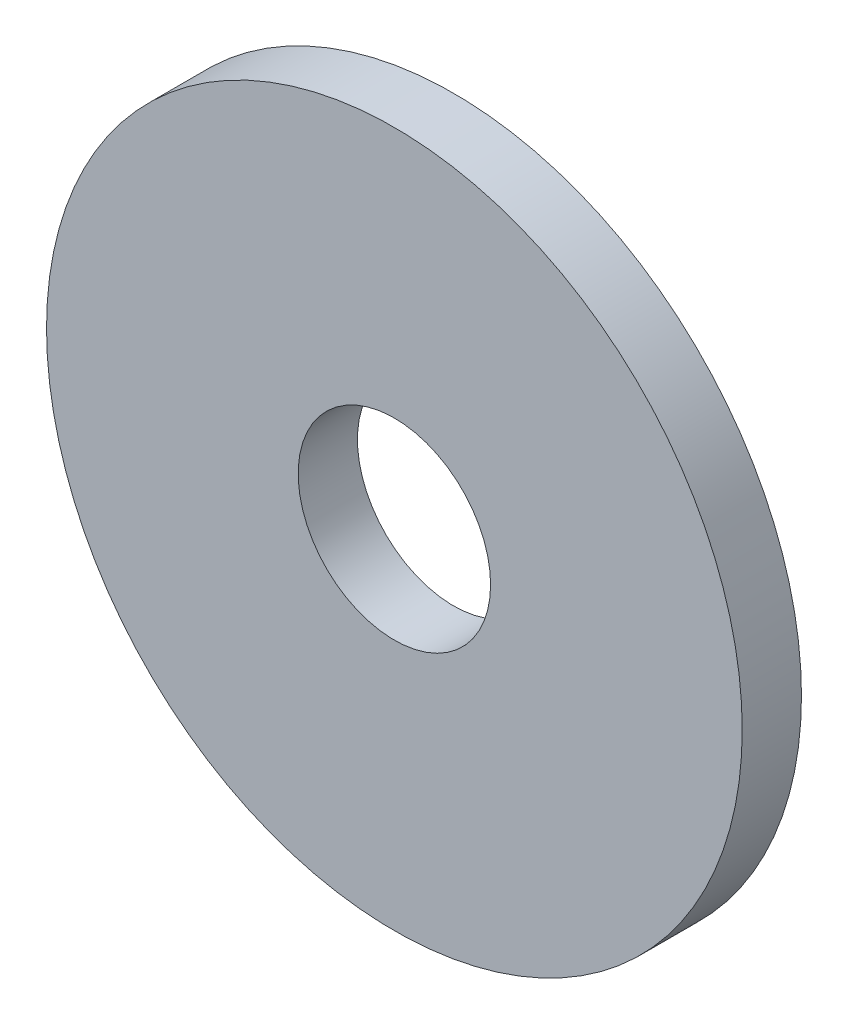
ISO-10303-21;
HEADER;
FILE_DESCRIPTION(('STEP AP214'),'2;1');
FILE_NAME('part.step','',(''),(''),'','','');
FILE_SCHEMA(('AUTOMOTIVE_DESIGN { 1 0 10303 214 1 1 1 1 }'));
ENDSEC;
DATA;
#1=APPLICATION_CONTEXT('core data for automotive mechanical design processes');
#2=APPLICATION_PROTOCOL_DEFINITION('international standard','automotive_design',2000,#1);
#3=PRODUCT_CONTEXT('',#1,'mechanical');
#4=PRODUCT('Part','Part','',(#3));
#5=PRODUCT_RELATED_PRODUCT_CATEGORY('part','',(#4));
#6=PRODUCT_DEFINITION_FORMATION('','',#4);
#7=PRODUCT_DEFINITION_CONTEXT('part definition',#1,'design');
#8=PRODUCT_DEFINITION('design','',#6,#7);
#9=PRODUCT_DEFINITION_SHAPE('','',#8);
#10=(LENGTH_UNIT() NAMED_UNIT(*) SI_UNIT(.MILLI.,.METRE.));
#11=(NAMED_UNIT(*) PLANE_ANGLE_UNIT() SI_UNIT($,.RADIAN.));
#12=(NAMED_UNIT(*) SI_UNIT($,.STERADIAN.) SOLID_ANGLE_UNIT());
#13=UNCERTAINTY_MEASURE_WITH_UNIT(LENGTH_MEASURE(1.E-05),#10,'distance_accuracy_value','');
#14=(GEOMETRIC_REPRESENTATION_CONTEXT(3) GLOBAL_UNCERTAINTY_ASSIGNED_CONTEXT((#13)) GLOBAL_UNIT_ASSIGNED_CONTEXT((#10,
#11,#12)) REPRESENTATION_CONTEXT('',''));
#15=CARTESIAN_POINT('',(0.,0.,0.));
#16=DIRECTION('',(0.,0.,1.));
#17=DIRECTION('',(1.,0.,0.));
#18=AXIS2_PLACEMENT_3D('',#15,#16,#17);
#19=CARTESIAN_POINT('',(0.,0.,0.79375));
#20=DIRECTION('',(0.,0.,1.));
#21=DIRECTION('',(1.,0.,0.));
#22=AXIS2_PLACEMENT_3D('',#19,#20,#21);
#23=PLANE('',#22);
#24=CARTESIAN_POINT('',(0.,0.,0.79375));
#25=DIRECTION('',(0.,0.,1.));
#26=DIRECTION('',(1.,0.,0.));
#27=AXIS2_PLACEMENT_3D('',#24,#25,#26);
#28=CIRCLE('',#27,9.3218);
#29=CARTESIAN_POINT('',(9.3218,0.,0.79375));
#30=VERTEX_POINT('',#29);
#31=EDGE_CURVE('E10',#30,#30,#28,.T.);
#32=ORIENTED_EDGE('',*,*,#31,.T.);
#33=EDGE_LOOP('',(#32));
#34=FACE_BOUND('',#33,.T.);
#35=CARTESIAN_POINT('',(0.,0.,0.79375));
#36=DIRECTION('',(0.,0.,1.));
#37=DIRECTION('',(1.,0.,0.));
#38=AXIS2_PLACEMENT_3D('',#35,#36,#37);
#39=CIRCLE('',#38,2.5781);
#40=CARTESIAN_POINT('',(2.5781,0.,0.79375));
#41=VERTEX_POINT('',#40);
#42=EDGE_CURVE('E52',#41,#41,#39,.T.);
#43=ORIENTED_EDGE('',*,*,#42,.F.);
#44=EDGE_LOOP('',(#43));
#45=FACE_BOUND('',#44,.T.);
#46=ADVANCED_FACE('F41',(#34,#45),#23,.T.);
#47=CARTESIAN_POINT('',(0.,0.,-0.79375));
#48=DIRECTION('',(0.,0.,1.));
#49=DIRECTION('',(1.,0.,0.));
#50=AXIS2_PLACEMENT_3D('',#47,#48,#49);
#51=PLANE('',#50);
#52=CARTESIAN_POINT('',(0.,0.,-0.79375));
#53=DIRECTION('',(0.,0.,1.));
#54=DIRECTION('',(1.,0.,0.));
#55=AXIS2_PLACEMENT_3D('',#52,#53,#54);
#56=CIRCLE('',#55,9.3218);
#57=CARTESIAN_POINT('',(9.3218,0.,-0.79375));
#58=VERTEX_POINT('',#57);
#59=EDGE_CURVE('E45',#58,#58,#56,.T.);
#60=ORIENTED_EDGE('',*,*,#59,.F.);
#61=EDGE_LOOP('',(#60));
#62=FACE_BOUND('',#61,.T.);
#63=CARTESIAN_POINT('',(0.,0.,-0.79375));
#64=DIRECTION('',(0.,0.,1.));
#65=DIRECTION('',(1.,0.,0.));
#66=AXIS2_PLACEMENT_3D('',#63,#64,#65);
#67=CIRCLE('',#66,2.5781);
#68=CARTESIAN_POINT('',(2.5781,0.,-0.79375));
#69=VERTEX_POINT('',#68);
#70=EDGE_CURVE('E54',#69,#69,#67,.T.);
#71=ORIENTED_EDGE('',*,*,#70,.T.);
#72=EDGE_LOOP('',(#71));
#73=FACE_BOUND('',#72,.T.);
#74=ADVANCED_FACE('F64',(#62,#73),#51,.F.);
#75=CARTESIAN_POINT('',(0.,0.,0.79375));
#76=DIRECTION('',(0.,0.,-1.));
#77=DIRECTION('',(-1.,0.,0.));
#78=AXIS2_PLACEMENT_3D('',#75,#76,#77);
#79=CYLINDRICAL_SURFACE('',#78,9.3218);
#80=ORIENTED_EDGE('',*,*,#31,.F.);
#81=EDGE_LOOP('',(#80));
#82=FACE_BOUND('',#81,.T.);
#83=ORIENTED_EDGE('',*,*,#59,.T.);
#84=EDGE_LOOP('',(#83));
#85=FACE_BOUND('',#84,.T.);
#86=ADVANCED_FACE('F43',(#82,#85),#79,.T.);
#87=CARTESIAN_POINT('',(0.,0.,0.79375));
#88=DIRECTION('',(0.,0.,-1.));
#89=DIRECTION('',(-1.,0.,0.));
#90=AXIS2_PLACEMENT_3D('',#87,#88,#89);
#91=CYLINDRICAL_SURFACE('',#90,2.5781);
#92=ORIENTED_EDGE('',*,*,#42,.T.);
#93=EDGE_LOOP('',(#92));
#94=FACE_BOUND('',#93,.T.);
#95=ORIENTED_EDGE('',*,*,#70,.F.);
#96=EDGE_LOOP('',(#95));
#97=FACE_BOUND('',#96,.T.);
#98=ADVANCED_FACE('F60',(#94,#97),#91,.F.);
#99=CLOSED_SHELL('',(#46,#74,#86,#98));
#100=MANIFOLD_SOLID_BREP('B2',#99);
#101=ADVANCED_BREP_SHAPE_REPRESENTATION('',(#18,#100),#14);
#102=SHAPE_DEFINITION_REPRESENTATION(#9,#101);
ENDSEC;
END-ISO-10303-21;
